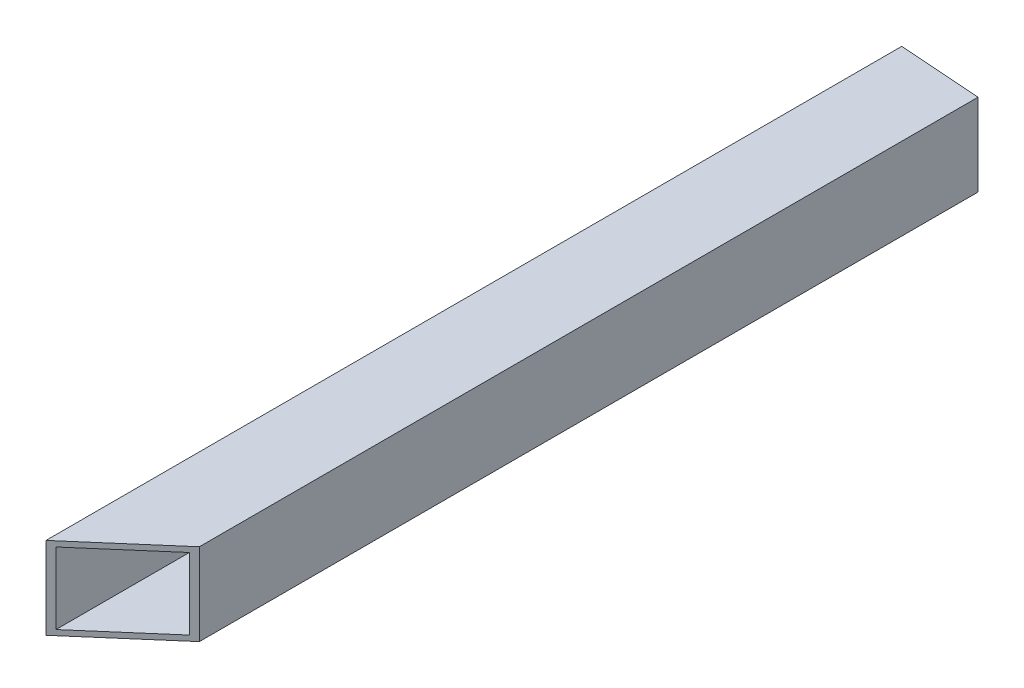
ISO-10303-21;
HEADER;
FILE_DESCRIPTION(('STEP AP214'),'2;1');
FILE_NAME('part.step','',(''),(''),'','','');
FILE_SCHEMA(('AUTOMOTIVE_DESIGN { 1 0 10303 214 1 1 1 1 }'));
ENDSEC;
DATA;
#1=APPLICATION_CONTEXT('core data for automotive mechanical design processes');
#2=APPLICATION_PROTOCOL_DEFINITION('international standard','automotive_design',2000,#1);
#3=PRODUCT_CONTEXT('',#1,'mechanical');
#4=PRODUCT('Part','Part','',(#3));
#5=PRODUCT_RELATED_PRODUCT_CATEGORY('part','',(#4));
#6=PRODUCT_DEFINITION_FORMATION('','',#4);
#7=PRODUCT_DEFINITION_CONTEXT('part definition',#1,'design');
#8=PRODUCT_DEFINITION('design','',#6,#7);
#9=PRODUCT_DEFINITION_SHAPE('','',#8);
#10=(LENGTH_UNIT() NAMED_UNIT(*) SI_UNIT(.MILLI.,.METRE.));
#11=(NAMED_UNIT(*) PLANE_ANGLE_UNIT() SI_UNIT($,.RADIAN.));
#12=(NAMED_UNIT(*) SI_UNIT($,.STERADIAN.) SOLID_ANGLE_UNIT());
#13=UNCERTAINTY_MEASURE_WITH_UNIT(LENGTH_MEASURE(1.E-05),#10,'distance_accuracy_value','');
#14=(GEOMETRIC_REPRESENTATION_CONTEXT(3) GLOBAL_UNCERTAINTY_ASSIGNED_CONTEXT((#13)) GLOBAL_UNIT_ASSIGNED_CONTEXT((#10,
#11,#12)) REPRESENTATION_CONTEXT('',''));
#15=CARTESIAN_POINT('',(0.,0.,0.));
#16=DIRECTION('',(0.,0.,1.));
#17=DIRECTION('',(1.,0.,0.));
#18=AXIS2_PLACEMENT_3D('',#15,#16,#17);
#19=CARTESIAN_POINT('',(-12.7,12.7,252.579));
#20=DIRECTION('',(1.,0.,0.));
#21=DIRECTION('',(0.,0.,-1.));
#22=AXIS2_PLACEMENT_3D('',#19,#20,#21);
#23=PLANE('',#22);
#24=DIRECTION('',(0.,1.,0.));
#25=VECTOR('',#24,1.);
#26=CARTESIAN_POINT('',(-12.7,12.7,-0.909233347784255));
#27=LINE('',#26,#25);
#28=CARTESIAN_POINT('',(-12.7,-12.7,-0.909233347784226));
#29=VERTEX_POINT('',#28);
#30=CARTESIAN_POINT('',(-12.7,12.7,-0.909233347784183));
#31=VERTEX_POINT('',#30);
#32=EDGE_CURVE('E47',#29,#31,#27,.T.);
#33=ORIENTED_EDGE('',*,*,#32,.F.);
#34=DIRECTION('',(0.,0.,-1.));
#35=VECTOR('',#34,1.);
#36=CARTESIAN_POINT('',(-12.7,-12.7,252.579));
#37=LINE('',#36,#35);
#38=CARTESIAN_POINT('',(-12.7,-12.7,263.582025126872));
#39=VERTEX_POINT('',#38);
#40=EDGE_CURVE('E111',#39,#29,#37,.T.);
#41=ORIENTED_EDGE('',*,*,#40,.F.);
#42=DIRECTION('',(0.,1.,0.));
#43=VECTOR('',#42,1.);
#44=CARTESIAN_POINT('',(-12.7,12.7,263.582025126872));
#45=LINE('',#44,#43);
#46=CARTESIAN_POINT('',(-12.7,12.7,263.582025126872));
#47=VERTEX_POINT('',#46);
#48=EDGE_CURVE('E150',#39,#47,#45,.T.);
#49=ORIENTED_EDGE('',*,*,#48,.T.);
#50=DIRECTION('',(0.,0.,-1.));
#51=VECTOR('',#50,1.);
#52=CARTESIAN_POINT('',(-12.7,12.7,252.579));
#53=LINE('',#52,#51);
#54=EDGE_CURVE('E119',#47,#31,#53,.T.);
#55=ORIENTED_EDGE('',*,*,#54,.T.);
#56=EDGE_LOOP('',(#33,#41,#49,#55));
#57=FACE_BOUND('',#56,.T.);
#58=ADVANCED_FACE('F33',(#57),#23,.F.);
#59=CARTESIAN_POINT('',(12.7,-12.7,252.579));
#60=DIRECTION('',(0.,1.,0.));
#61=DIRECTION('',(-1.,0.,0.));
#62=AXIS2_PLACEMENT_3D('',#59,#60,#61);
#63=PLANE('',#62);
#64=DIRECTION('',(-0.997447018462015,0.,-0.0714104009317799));
#65=VECTOR('',#64,1.);
#66=CARTESIAN_POINT('',(25.4132672330979,-12.7,1.81941653893579));
#67=LINE('',#66,#65);
#68=CARTESIAN_POINT('',(12.7,-12.7,0.909233347784205));
#69=VERTEX_POINT('',#68);
#70=EDGE_CURVE('E97',#69,#29,#67,.T.);
#71=ORIENTED_EDGE('',*,*,#70,.F.);
#72=DIRECTION('',(0.,0.,-1.));
#73=VECTOR('',#72,1.);
#74=CARTESIAN_POINT('',(12.7,-12.7,252.579));
#75=LINE('',#74,#73);
#76=CARTESIAN_POINT('',(12.7,-12.7,241.575974873127));
#77=VERTEX_POINT('',#76);
#78=EDGE_CURVE('E109',#77,#69,#75,.T.);
#79=ORIENTED_EDGE('',*,*,#78,.F.);
#80=DIRECTION('',(-0.755796329374905,0.,0.654806771882683));
#81=VECTOR('',#80,1.);
#82=CARTESIAN_POINT('',(7.25459676200661,-12.7,246.293762956088));
#83=LINE('',#82,#81);
#84=EDGE_CURVE('E174',#77,#39,#83,.T.);
#85=ORIENTED_EDGE('',*,*,#84,.T.);
#86=ORIENTED_EDGE('',*,*,#40,.T.);
#87=EDGE_LOOP('',(#71,#79,#85,#86));
#88=FACE_BOUND('',#87,.T.);
#89=ADVANCED_FACE('F107',(#88),#63,.F.);
#90=CARTESIAN_POINT('',(12.7,12.7,252.579));
#91=DIRECTION('',(-1.,0.,0.));
#92=DIRECTION('',(0.,-1.,0.));
#93=AXIS2_PLACEMENT_3D('',#90,#91,#92);
#94=PLANE('',#93);
#95=DIRECTION('',(0.,-1.,0.));
#96=VECTOR('',#95,1.);
#97=CARTESIAN_POINT('',(12.7,12.7,0.9092333477842));
#98=LINE('',#97,#96);
#99=CARTESIAN_POINT('',(12.7,12.7,0.909233347784215));
#100=VERTEX_POINT('',#99);
#101=EDGE_CURVE('E94',#100,#69,#98,.T.);
#102=ORIENTED_EDGE('',*,*,#101,.F.);
#103=DIRECTION('',(0.,0.,-1.));
#104=VECTOR('',#103,1.);
#105=CARTESIAN_POINT('',(12.7,12.7,252.579));
#106=LINE('',#105,#104);
#107=CARTESIAN_POINT('',(12.7,12.7,241.575974873127));
#108=VERTEX_POINT('',#107);
#109=EDGE_CURVE('E116',#108,#100,#106,.T.);
#110=ORIENTED_EDGE('',*,*,#109,.F.);
#111=DIRECTION('',(0.,-1.,0.));
#112=VECTOR('',#111,1.);
#113=CARTESIAN_POINT('',(12.7,12.7,241.575974873127));
#114=LINE('',#113,#112);
#115=EDGE_CURVE('E115',#108,#77,#114,.T.);
#116=ORIENTED_EDGE('',*,*,#115,.T.);
#117=ORIENTED_EDGE('',*,*,#78,.T.);
#118=EDGE_LOOP('',(#102,#110,#116,#117));
#119=FACE_BOUND('',#118,.T.);
#120=ADVANCED_FACE('F114',(#119),#94,.F.);
#121=CARTESIAN_POINT('',(12.7,12.7,252.579));
#122=DIRECTION('',(0.,-1.,0.));
#123=DIRECTION('',(1.,0.,0.));
#124=AXIS2_PLACEMENT_3D('',#121,#122,#123);
#125=PLANE('',#124);
#126=DIRECTION('',(0.997447018462015,0.,0.0714104009317799));
#127=VECTOR('',#126,1.);
#128=CARTESIAN_POINT('',(30.6259571660272,12.7,2.19260957190259));
#129=LINE('',#128,#127);
#130=EDGE_CURVE('E98',#31,#100,#129,.T.);
#131=ORIENTED_EDGE('',*,*,#130,.F.);
#132=ORIENTED_EDGE('',*,*,#54,.F.);
#133=DIRECTION('',(0.755796329374905,0.,-0.654806771882683));
#134=VECTOR('',#133,1.);
#135=CARTESIAN_POINT('',(25.0493443054448,12.7,230.876750802796));
#136=LINE('',#135,#134);
#137=EDGE_CURVE('E143',#47,#108,#136,.T.);
#138=ORIENTED_EDGE('',*,*,#137,.T.);
#139=ORIENTED_EDGE('',*,*,#109,.T.);
#140=EDGE_LOOP('',(#131,#132,#138,#139));
#141=FACE_BOUND('',#140,.T.);
#142=ADVANCED_FACE('F161',(#141),#125,.F.);
#143=CARTESIAN_POINT('',(-11.049,11.049,252.579));
#144=DIRECTION('',(1.,0.,0.));
#145=DIRECTION('',(0.,1.,0.));
#146=AXIS2_PLACEMENT_3D('',#143,#144,#145);
#147=PLANE('',#146);
#148=DIRECTION('',(0.,0.,-1.));
#149=VECTOR('',#148,1.);
#150=CARTESIAN_POINT('',(-11.049,-11.049,252.579));
#151=LINE('',#150,#149);
#152=CARTESIAN_POINT('',(-11.049,-11.049,262.151631860379));
#153=VERTEX_POINT('',#152);
#154=CARTESIAN_POINT('',(-11.049,-11.049,-0.791033012572241));
#155=VERTEX_POINT('',#154);
#156=EDGE_CURVE('E148',#153,#155,#151,.T.);
#157=ORIENTED_EDGE('',*,*,#156,.T.);
#158=DIRECTION('',(0.,1.,0.));
#159=VECTOR('',#158,1.);
#160=CARTESIAN_POINT('',(-11.049,11.049,-0.791033012572273));
#161=LINE('',#160,#159);
#162=CARTESIAN_POINT('',(-11.049,11.049,-0.791033012572241));
#163=VERTEX_POINT('',#162);
#164=EDGE_CURVE('E162',#155,#163,#161,.T.);
#165=ORIENTED_EDGE('',*,*,#164,.T.);
#166=DIRECTION('',(0.,0.,-1.));
#167=VECTOR('',#166,1.);
#168=CARTESIAN_POINT('',(-11.049,11.049,252.579));
#169=LINE('',#168,#167);
#170=CARTESIAN_POINT('',(-11.049,11.049,262.151631860379));
#171=VERTEX_POINT('',#170);
#172=EDGE_CURVE('E146',#171,#163,#169,.T.);
#173=ORIENTED_EDGE('',*,*,#172,.F.);
#174=DIRECTION('',(0.,1.,0.));
#175=VECTOR('',#174,1.);
#176=CARTESIAN_POINT('',(-11.049,11.049,262.151631860379));
#177=LINE('',#176,#175);
#178=EDGE_CURVE('E130',#153,#171,#177,.T.);
#179=ORIENTED_EDGE('',*,*,#178,.F.);
#180=EDGE_LOOP('',(#157,#165,#173,#179));
#181=FACE_BOUND('',#180,.T.);
#182=ADVANCED_FACE('F194',(#181),#147,.T.);
#183=CARTESIAN_POINT('',(11.049,-11.049,252.579));
#184=DIRECTION('',(0.,1.,0.));
#185=DIRECTION('',(-1.,0.,0.));
#186=AXIS2_PLACEMENT_3D('',#183,#184,#185);
#187=PLANE('',#186);
#188=DIRECTION('',(0.,0.,-1.));
#189=VECTOR('',#188,1.);
#190=CARTESIAN_POINT('',(11.049,-11.049,252.579));
#191=LINE('',#190,#189);
#192=CARTESIAN_POINT('',(11.049,-11.049,243.006368139621));
#193=VERTEX_POINT('',#192);
#194=CARTESIAN_POINT('',(11.049,-11.049,0.791033012572273));
#195=VERTEX_POINT('',#194);
#196=EDGE_CURVE('E141',#193,#195,#191,.T.);
#197=ORIENTED_EDGE('',*,*,#196,.T.);
#198=DIRECTION('',(-0.997447018462015,0.,-0.0714104009317799));
#199=VECTOR('',#198,1.);
#200=CARTESIAN_POINT('',(28.9833763503186,-11.049,2.07501199284177));
#201=LINE('',#200,#199);
#202=EDGE_CURVE('E165',#195,#155,#201,.T.);
#203=ORIENTED_EDGE('',*,*,#202,.T.);
#204=ORIENTED_EDGE('',*,*,#156,.F.);
#205=DIRECTION('',(-0.755796329374905,0.,0.654806771882683));
#206=VECTOR('',#205,1.);
#207=CARTESIAN_POINT('',(6.31149918294575,-11.049,247.110843771796));
#208=LINE('',#207,#206);
#209=EDGE_CURVE('E142',#193,#153,#208,.T.);
#210=ORIENTED_EDGE('',*,*,#209,.F.);
#211=EDGE_LOOP('',(#197,#203,#204,#210));
#212=FACE_BOUND('',#211,.T.);
#213=ADVANCED_FACE('F197',(#212),#187,.T.);
#214=CARTESIAN_POINT('',(11.049,11.049,252.579));
#215=DIRECTION('',(-1.,0.,0.));
#216=DIRECTION('',(0.,-1.,0.));
#217=AXIS2_PLACEMENT_3D('',#214,#215,#216);
#218=PLANE('',#217);
#219=DIRECTION('',(0.,0.,-1.));
#220=VECTOR('',#219,1.);
#221=CARTESIAN_POINT('',(11.049,11.049,252.579));
#222=LINE('',#221,#220);
#223=CARTESIAN_POINT('',(11.049,11.049,243.006368139621));
#224=VERTEX_POINT('',#223);
#225=CARTESIAN_POINT('',(11.049,11.049,0.791033012572341));
#226=VERTEX_POINT('',#225);
#227=EDGE_CURVE('E139',#224,#226,#222,.T.);
#228=ORIENTED_EDGE('',*,*,#227,.T.);
#229=DIRECTION('',(0.,-1.,0.));
#230=VECTOR('',#229,1.);
#231=CARTESIAN_POINT('',(11.049,11.049,0.791033012572273));
#232=LINE('',#231,#230);
#233=EDGE_CURVE('E55',#226,#195,#232,.T.);
#234=ORIENTED_EDGE('',*,*,#233,.T.);
#235=ORIENTED_EDGE('',*,*,#196,.F.);
#236=DIRECTION('',(0.,-1.,0.));
#237=VECTOR('',#236,1.);
#238=CARTESIAN_POINT('',(11.049,11.049,243.006368139621));
#239=LINE('',#238,#237);
#240=EDGE_CURVE('E127',#224,#193,#239,.T.);
#241=ORIENTED_EDGE('',*,*,#240,.F.);
#242=EDGE_LOOP('',(#228,#234,#235,#241));
#243=FACE_BOUND('',#242,.T.);
#244=ADVANCED_FACE('F138',(#243),#218,.T.);
#245=CARTESIAN_POINT('',(11.049,11.049,252.579));
#246=DIRECTION('',(0.,-1.,0.));
#247=DIRECTION('',(1.,0.,0.));
#248=AXIS2_PLACEMENT_3D('',#245,#246,#247);
#249=PLANE('',#248);
#250=ORIENTED_EDGE('',*,*,#172,.T.);
#251=DIRECTION('',(0.997447018462015,0.,0.0714104009317799));
#252=VECTOR('',#251,1.);
#253=CARTESIAN_POINT('',(28.9833763503186,11.049,2.07501199284177));
#254=LINE('',#253,#252);
#255=EDGE_CURVE('E11',#163,#226,#254,.T.);
#256=ORIENTED_EDGE('',*,*,#255,.T.);
#257=ORIENTED_EDGE('',*,*,#227,.F.);
#258=DIRECTION('',(0.755796329374905,0.,-0.654806771882683));
#259=VECTOR('',#258,1.);
#260=CARTESIAN_POINT('',(6.31149918294574,11.049,247.110843771796));
#261=LINE('',#260,#259);
#262=EDGE_CURVE('E40',#171,#224,#261,.T.);
#263=ORIENTED_EDGE('',*,*,#262,.F.);
#264=EDGE_LOOP('',(#250,#256,#257,#263));
#265=FACE_BOUND('',#264,.T.);
#266=ADVANCED_FACE('F145',(#265),#249,.T.);
#267=CARTESIAN_POINT('',(25.0493443054448,12.7,230.876750802796));
#268=DIRECTION('',(-0.654806771882683,0.,-0.755796329374905));
#269=DIRECTION('',(-0.755796329374905,0.,0.654806771882683));
#270=AXIS2_PLACEMENT_3D('',#267,#268,#269);
#271=PLANE('',#270);
#272=ORIENTED_EDGE('',*,*,#178,.T.);
#273=ORIENTED_EDGE('',*,*,#262,.T.);
#274=ORIENTED_EDGE('',*,*,#240,.T.);
#275=ORIENTED_EDGE('',*,*,#209,.T.);
#276=EDGE_LOOP('',(#272,#273,#274,#275));
#277=FACE_BOUND('',#276,.T.);
#278=ORIENTED_EDGE('',*,*,#84,.F.);
#279=ORIENTED_EDGE('',*,*,#115,.F.);
#280=ORIENTED_EDGE('',*,*,#137,.F.);
#281=ORIENTED_EDGE('',*,*,#48,.F.);
#282=EDGE_LOOP('',(#278,#279,#280,#281));
#283=FACE_BOUND('',#282,.T.);
#284=ADVANCED_FACE('F125',(#277,#283),#271,.F.);
#285=CARTESIAN_POINT('',(25.4132672330979,-12.7,1.81941653893579));
#286=DIRECTION('',(0.0714104009317799,0.,-0.997447018462015));
#287=DIRECTION('',(-0.997447018462015,0.,-0.0714104009317799));
#288=AXIS2_PLACEMENT_3D('',#285,#286,#287);
#289=PLANE('',#288);
#290=ORIENTED_EDGE('',*,*,#202,.F.);
#291=ORIENTED_EDGE('',*,*,#233,.F.);
#292=ORIENTED_EDGE('',*,*,#255,.F.);
#293=ORIENTED_EDGE('',*,*,#164,.F.);
#294=EDGE_LOOP('',(#290,#291,#292,#293));
#295=FACE_BOUND('',#294,.T.);
#296=ORIENTED_EDGE('',*,*,#32,.T.);
#297=ORIENTED_EDGE('',*,*,#130,.T.);
#298=ORIENTED_EDGE('',*,*,#101,.T.);
#299=ORIENTED_EDGE('',*,*,#70,.T.);
#300=EDGE_LOOP('',(#296,#297,#298,#299));
#301=FACE_BOUND('',#300,.T.);
#302=ADVANCED_FACE('F96',(#295,#301),#289,.T.);
#303=CLOSED_SHELL('',(#58,#89,#120,#142,#182,#213,#244,#266,#284,#302));
#304=MANIFOLD_SOLID_BREP('B2',#303);
#305=ADVANCED_BREP_SHAPE_REPRESENTATION('',(#18,#304),#14);
#306=SHAPE_DEFINITION_REPRESENTATION(#9,#305);
ENDSEC;
END-ISO-10303-21;
